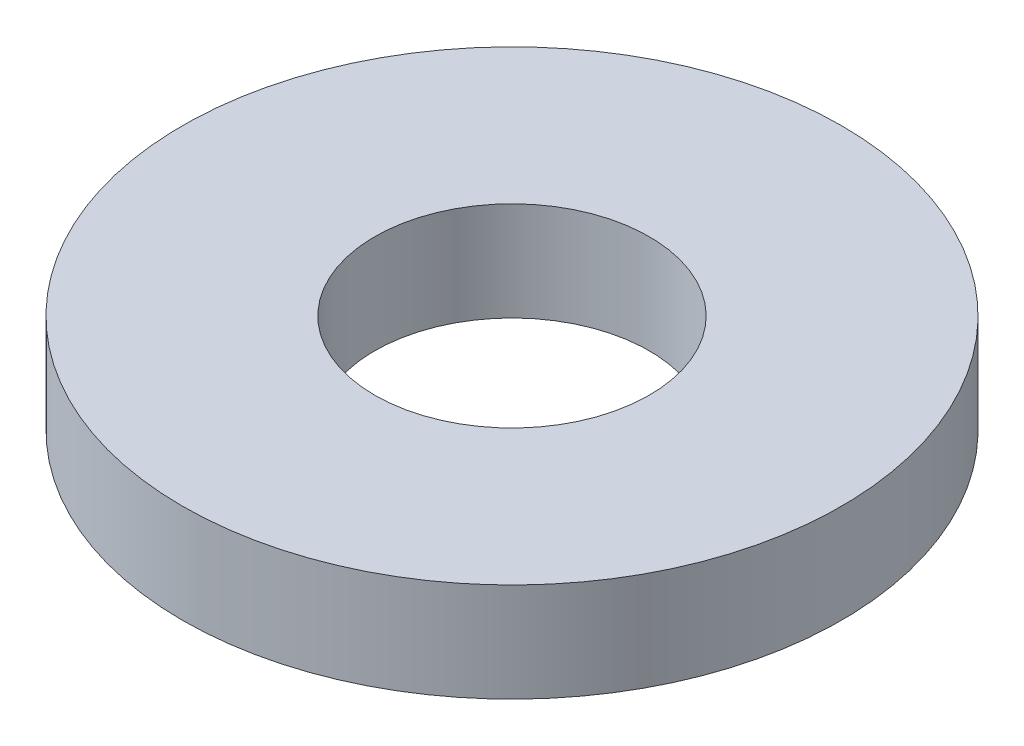
ISO-10303-21;
HEADER;
FILE_DESCRIPTION(('STEP AP214'),'2;1');
FILE_NAME('part.step','',(''),(''),'','','');
FILE_SCHEMA(('AUTOMOTIVE_DESIGN { 1 0 10303 214 1 1 1 1 }'));
ENDSEC;
DATA;
#1=APPLICATION_CONTEXT('core data for automotive mechanical design processes');
#2=APPLICATION_PROTOCOL_DEFINITION('international standard','automotive_design',2000,#1);
#3=PRODUCT_CONTEXT('',#1,'mechanical');
#4=PRODUCT('Part','Part','',(#3));
#5=PRODUCT_RELATED_PRODUCT_CATEGORY('part','',(#4));
#6=PRODUCT_DEFINITION_FORMATION('','',#4);
#7=PRODUCT_DEFINITION_CONTEXT('part definition',#1,'design');
#8=PRODUCT_DEFINITION('design','',#6,#7);
#9=PRODUCT_DEFINITION_SHAPE('','',#8);
#10=(LENGTH_UNIT() NAMED_UNIT(*) SI_UNIT(.MILLI.,.METRE.));
#11=(NAMED_UNIT(*) PLANE_ANGLE_UNIT() SI_UNIT($,.RADIAN.));
#12=(NAMED_UNIT(*) SI_UNIT($,.STERADIAN.) SOLID_ANGLE_UNIT());
#13=UNCERTAINTY_MEASURE_WITH_UNIT(LENGTH_MEASURE(1.E-05),#10,'distance_accuracy_value','');
#14=(GEOMETRIC_REPRESENTATION_CONTEXT(3) GLOBAL_UNCERTAINTY_ASSIGNED_CONTEXT((#13)) GLOBAL_UNIT_ASSIGNED_CONTEXT((#10,
#11,#12)) REPRESENTATION_CONTEXT('',''));
#15=CARTESIAN_POINT('',(0.,0.,0.));
#16=DIRECTION('',(0.,0.,1.));
#17=DIRECTION('',(1.,0.,0.));
#18=AXIS2_PLACEMENT_3D('',#15,#16,#17);
#19=CARTESIAN_POINT('',(0.,18.,0.));
#20=DIRECTION('',(0.,-1.,0.));
#21=DIRECTION('',(0.,0.,-1.));
#22=AXIS2_PLACEMENT_3D('',#19,#20,#21);
#23=CYLINDRICAL_SURFACE('',#22,60.);
#24=CARTESIAN_POINT('',(0.,18.,0.));
#25=DIRECTION('',(0.,1.,0.));
#26=DIRECTION('',(0.,0.,1.));
#27=AXIS2_PLACEMENT_3D('',#24,#25,#26);
#28=CIRCLE('',#27,60.);
#29=CARTESIAN_POINT('',(0.,18.,60.));
#30=VERTEX_POINT('',#29);
#31=EDGE_CURVE('E10',#30,#30,#28,.T.);
#32=ORIENTED_EDGE('',*,*,#31,.F.);
#33=EDGE_LOOP('',(#32));
#34=FACE_BOUND('',#33,.T.);
#35=CARTESIAN_POINT('',(0.,0.,0.));
#36=DIRECTION('',(0.,1.,0.));
#37=DIRECTION('',(0.,0.,1.));
#38=AXIS2_PLACEMENT_3D('',#35,#36,#37);
#39=CIRCLE('',#38,60.);
#40=CARTESIAN_POINT('',(0.,0.,60.));
#41=VERTEX_POINT('',#40);
#42=EDGE_CURVE('E37',#41,#41,#39,.T.);
#43=ORIENTED_EDGE('',*,*,#42,.T.);
#44=EDGE_LOOP('',(#43));
#45=FACE_BOUND('',#44,.T.);
#46=ADVANCED_FACE('F40',(#34,#45),#23,.T.);
#47=CARTESIAN_POINT('',(0.,18.,0.));
#48=DIRECTION('',(0.,1.,0.));
#49=DIRECTION('',(0.,0.,1.));
#50=AXIS2_PLACEMENT_3D('',#47,#48,#49);
#51=PLANE('',#50);
#52=CARTESIAN_POINT('',(0.,18.,0.));
#53=DIRECTION('',(0.,1.,0.));
#54=DIRECTION('',(0.,0.,1.));
#55=AXIS2_PLACEMENT_3D('',#52,#53,#54);
#56=CIRCLE('',#55,25.);
#57=CARTESIAN_POINT('',(0.,18.,25.));
#58=VERTEX_POINT('',#57);
#59=EDGE_CURVE('E50',#58,#58,#56,.T.);
#60=ORIENTED_EDGE('',*,*,#59,.F.);
#61=EDGE_LOOP('',(#60));
#62=FACE_BOUND('',#61,.T.);
#63=ORIENTED_EDGE('',*,*,#31,.T.);
#64=EDGE_LOOP('',(#63));
#65=FACE_BOUND('',#64,.T.);
#66=ADVANCED_FACE('F59',(#62,#65),#51,.T.);
#67=CARTESIAN_POINT('',(0.,0.,0.));
#68=DIRECTION('',(0.,1.,0.));
#69=DIRECTION('',(0.,0.,1.));
#70=AXIS2_PLACEMENT_3D('',#67,#68,#69);
#71=PLANE('',#70);
#72=CARTESIAN_POINT('',(0.,0.,0.));
#73=DIRECTION('',(0.,1.,0.));
#74=DIRECTION('',(0.,0.,1.));
#75=AXIS2_PLACEMENT_3D('',#72,#73,#74);
#76=CIRCLE('',#75,25.);
#77=CARTESIAN_POINT('',(0.,0.,25.));
#78=VERTEX_POINT('',#77);
#79=EDGE_CURVE('E47',#78,#78,#76,.T.);
#80=ORIENTED_EDGE('',*,*,#79,.T.);
#81=EDGE_LOOP('',(#80));
#82=FACE_BOUND('',#81,.T.);
#83=ORIENTED_EDGE('',*,*,#42,.F.);
#84=EDGE_LOOP('',(#83));
#85=FACE_BOUND('',#84,.T.);
#86=ADVANCED_FACE('F58',(#82,#85),#71,.F.);
#87=CARTESIAN_POINT('',(0.,18.,0.));
#88=DIRECTION('',(0.,-1.,0.));
#89=DIRECTION('',(0.,0.,-1.));
#90=AXIS2_PLACEMENT_3D('',#87,#88,#89);
#91=CYLINDRICAL_SURFACE('',#90,25.);
#92=ORIENTED_EDGE('',*,*,#59,.T.);
#93=EDGE_LOOP('',(#92));
#94=FACE_BOUND('',#93,.T.);
#95=ORIENTED_EDGE('',*,*,#79,.F.);
#96=EDGE_LOOP('',(#95));
#97=FACE_BOUND('',#96,.T.);
#98=ADVANCED_FACE('F54',(#94,#97),#91,.F.);
#99=CLOSED_SHELL('',(#46,#66,#86,#98));
#100=MANIFOLD_SOLID_BREP('B2',#99);
#101=ADVANCED_BREP_SHAPE_REPRESENTATION('',(#18,#100),#14);
#102=SHAPE_DEFINITION_REPRESENTATION(#9,#101);
ENDSEC;
END-ISO-10303-21;
